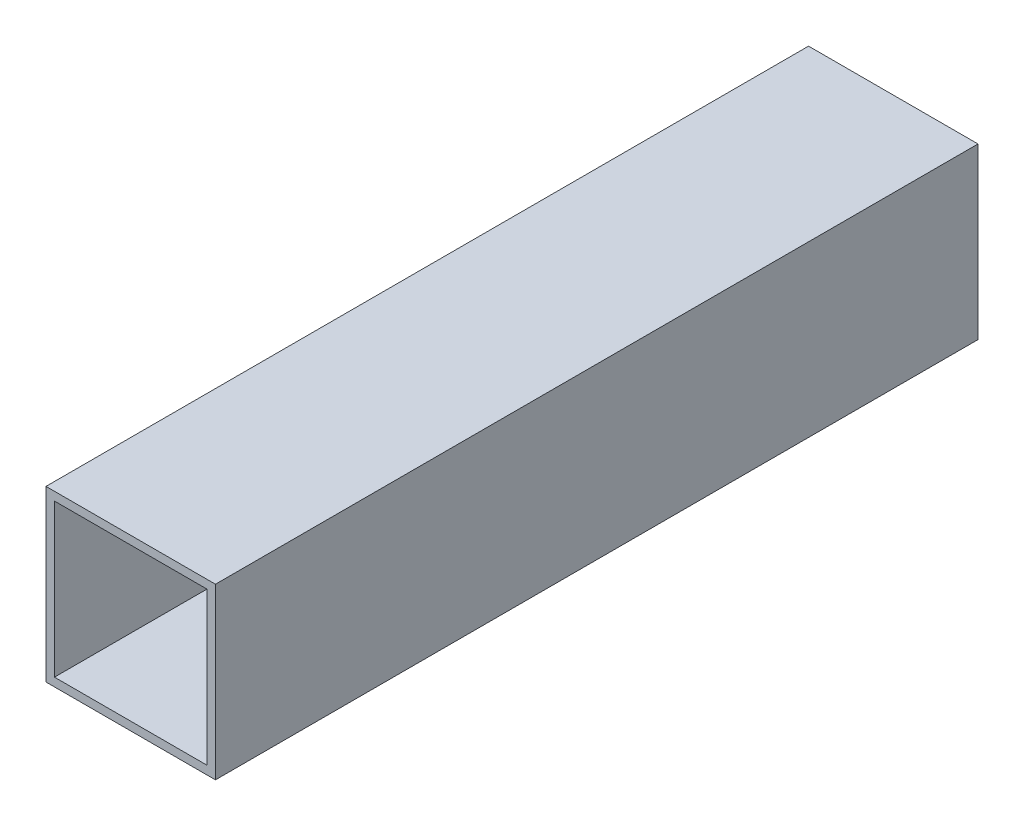
ISO-10303-21;
HEADER;
FILE_DESCRIPTION(('STEP AP214'),'2;1');
FILE_NAME('part.step','',(''),(''),'','','');
FILE_SCHEMA(('AUTOMOTIVE_DESIGN { 1 0 10303 214 1 1 1 1 }'));
ENDSEC;
DATA;
#1=APPLICATION_CONTEXT('core data for automotive mechanical design processes');
#2=APPLICATION_PROTOCOL_DEFINITION('international standard','automotive_design',2000,#1);
#3=PRODUCT_CONTEXT('',#1,'mechanical');
#4=PRODUCT('Part','Part','',(#3));
#5=PRODUCT_RELATED_PRODUCT_CATEGORY('part','',(#4));
#6=PRODUCT_DEFINITION_FORMATION('','',#4);
#7=PRODUCT_DEFINITION_CONTEXT('part definition',#1,'design');
#8=PRODUCT_DEFINITION('design','',#6,#7);
#9=PRODUCT_DEFINITION_SHAPE('','',#8);
#10=(LENGTH_UNIT() NAMED_UNIT(*) SI_UNIT(.MILLI.,.METRE.));
#11=(NAMED_UNIT(*) PLANE_ANGLE_UNIT() SI_UNIT($,.RADIAN.));
#12=(NAMED_UNIT(*) SI_UNIT($,.STERADIAN.) SOLID_ANGLE_UNIT());
#13=UNCERTAINTY_MEASURE_WITH_UNIT(LENGTH_MEASURE(1.E-05),#10,'distance_accuracy_value','');
#14=(GEOMETRIC_REPRESENTATION_CONTEXT(3) GLOBAL_UNCERTAINTY_ASSIGNED_CONTEXT((#13)) GLOBAL_UNIT_ASSIGNED_CONTEXT((#10,
#11,#12)) REPRESENTATION_CONTEXT('',''));
#15=CARTESIAN_POINT('',(0.,0.,0.));
#16=DIRECTION('',(0.,0.,1.));
#17=DIRECTION('',(1.,0.,0.));
#18=AXIS2_PLACEMENT_3D('',#15,#16,#17);
#19=CARTESIAN_POINT('',(0.,0.,225.));
#20=DIRECTION('',(0.,0.,-1.));
#21=DIRECTION('',(-1.,0.,0.));
#22=AXIS2_PLACEMENT_3D('',#19,#20,#21);
#23=PLANE('',#22);
#24=DIRECTION('',(0.,-1.,0.));
#25=VECTOR('',#24,1.);
#26=CARTESIAN_POINT('',(-50.,-50.,225.));
#27=LINE('',#26,#25);
#28=CARTESIAN_POINT('',(-50.,49.9999999999999,225.));
#29=VERTEX_POINT('',#28);
#30=CARTESIAN_POINT('',(-50.,-50.,225.));
#31=VERTEX_POINT('',#30);
#32=EDGE_CURVE('E139',#29,#31,#27,.T.);
#33=ORIENTED_EDGE('',*,*,#32,.T.);
#34=DIRECTION('',(1.,0.,0.));
#35=VECTOR('',#34,1.);
#36=CARTESIAN_POINT('',(-50.,-50.,225.));
#37=LINE('',#36,#35);
#38=CARTESIAN_POINT('',(50.,-50.,225.));
#39=VERTEX_POINT('',#38);
#40=EDGE_CURVE('E141',#31,#39,#37,.T.);
#41=ORIENTED_EDGE('',*,*,#40,.T.);
#42=DIRECTION('',(0.,1.,0.));
#43=VECTOR('',#42,1.);
#44=CARTESIAN_POINT('',(50.,-50.,225.));
#45=LINE('',#44,#43);
#46=CARTESIAN_POINT('',(49.9999999999999,49.9999999999999,225.));
#47=VERTEX_POINT('',#46);
#48=EDGE_CURVE('E148',#39,#47,#45,.T.);
#49=ORIENTED_EDGE('',*,*,#48,.T.);
#50=DIRECTION('',(-1.,0.,0.));
#51=VECTOR('',#50,1.);
#52=CARTESIAN_POINT('',(-50.,49.9999999999999,225.));
#53=LINE('',#52,#51);
#54=EDGE_CURVE('E146',#47,#29,#53,.T.);
#55=ORIENTED_EDGE('',*,*,#54,.T.);
#56=EDGE_LOOP('',(#33,#41,#49,#55));
#57=FACE_BOUND('',#56,.T.);
#58=DIRECTION('',(0.,-1.,0.));
#59=VECTOR('',#58,1.);
#60=CARTESIAN_POINT('',(-45.,-45.,225.));
#61=LINE('',#60,#59);
#62=CARTESIAN_POINT('',(-45.,44.9999999999999,225.));
#63=VERTEX_POINT('',#62);
#64=CARTESIAN_POINT('',(-45.,-45.,225.));
#65=VERTEX_POINT('',#64);
#66=EDGE_CURVE('E102',#63,#65,#61,.T.);
#67=ORIENTED_EDGE('',*,*,#66,.F.);
#68=DIRECTION('',(-1.,0.,0.));
#69=VECTOR('',#68,1.);
#70=CARTESIAN_POINT('',(-45.,44.9999999999999,225.));
#71=LINE('',#70,#69);
#72=CARTESIAN_POINT('',(45.,44.9999999999999,225.));
#73=VERTEX_POINT('',#72);
#74=EDGE_CURVE('E127',#73,#63,#71,.T.);
#75=ORIENTED_EDGE('',*,*,#74,.F.);
#76=DIRECTION('',(0.,1.,0.));
#77=VECTOR('',#76,1.);
#78=CARTESIAN_POINT('',(45.,-45.,225.));
#79=LINE('',#78,#77);
#80=CARTESIAN_POINT('',(45.,-45.,225.));
#81=VERTEX_POINT('',#80);
#82=EDGE_CURVE('E121',#81,#73,#79,.T.);
#83=ORIENTED_EDGE('',*,*,#82,.F.);
#84=DIRECTION('',(1.,0.,0.));
#85=VECTOR('',#84,1.);
#86=CARTESIAN_POINT('',(-45.,-45.,225.));
#87=LINE('',#86,#85);
#88=EDGE_CURVE('E115',#65,#81,#87,.T.);
#89=ORIENTED_EDGE('',*,*,#88,.F.);
#90=EDGE_LOOP('',(#67,#75,#83,#89));
#91=FACE_BOUND('',#90,.T.);
#92=ADVANCED_FACE('F39',(#57,#91),#23,.F.);
#93=CARTESIAN_POINT('',(0.,0.,-225.));
#94=DIRECTION('',(0.,0.,-1.));
#95=DIRECTION('',(-1.,0.,0.));
#96=AXIS2_PLACEMENT_3D('',#93,#94,#95);
#97=PLANE('',#96);
#98=DIRECTION('',(0.,-1.,0.));
#99=VECTOR('',#98,1.);
#100=CARTESIAN_POINT('',(-50.,-50.,-225.));
#101=LINE('',#100,#99);
#102=CARTESIAN_POINT('',(-50.,49.9999999999999,-225.));
#103=VERTEX_POINT('',#102);
#104=CARTESIAN_POINT('',(-50.,-50.,-225.));
#105=VERTEX_POINT('',#104);
#106=EDGE_CURVE('E118',#103,#105,#101,.T.);
#107=ORIENTED_EDGE('',*,*,#106,.F.);
#108=DIRECTION('',(-1.,0.,0.));
#109=VECTOR('',#108,1.);
#110=CARTESIAN_POINT('',(-50.,49.9999999999999,-225.));
#111=LINE('',#110,#109);
#112=CARTESIAN_POINT('',(49.9999999999999,49.9999999999999,-225.));
#113=VERTEX_POINT('',#112);
#114=EDGE_CURVE('E145',#113,#103,#111,.T.);
#115=ORIENTED_EDGE('',*,*,#114,.F.);
#116=DIRECTION('',(0.,1.,0.));
#117=VECTOR('',#116,1.);
#118=CARTESIAN_POINT('',(50.,-50.,-225.));
#119=LINE('',#118,#117);
#120=CARTESIAN_POINT('',(50.,-50.,-225.));
#121=VERTEX_POINT('',#120);
#122=EDGE_CURVE('E154',#121,#113,#119,.T.);
#123=ORIENTED_EDGE('',*,*,#122,.F.);
#124=DIRECTION('',(1.,0.,0.));
#125=VECTOR('',#124,1.);
#126=CARTESIAN_POINT('',(-50.,-50.,-225.));
#127=LINE('',#126,#125);
#128=EDGE_CURVE('E153',#105,#121,#127,.T.);
#129=ORIENTED_EDGE('',*,*,#128,.F.);
#130=EDGE_LOOP('',(#107,#115,#123,#129));
#131=FACE_BOUND('',#130,.T.);
#132=DIRECTION('',(-1.,0.,0.));
#133=VECTOR('',#132,1.);
#134=CARTESIAN_POINT('',(-45.,44.9999999999999,-225.));
#135=LINE('',#134,#133);
#136=CARTESIAN_POINT('',(45.,44.9999999999999,-225.));
#137=VERTEX_POINT('',#136);
#138=CARTESIAN_POINT('',(-45.,44.9999999999999,-225.));
#139=VERTEX_POINT('',#138);
#140=EDGE_CURVE('E114',#137,#139,#135,.T.);
#141=ORIENTED_EDGE('',*,*,#140,.T.);
#142=DIRECTION('',(0.,-1.,0.));
#143=VECTOR('',#142,1.);
#144=CARTESIAN_POINT('',(-45.,-45.,-225.));
#145=LINE('',#144,#143);
#146=CARTESIAN_POINT('',(-45.,-45.,-225.));
#147=VERTEX_POINT('',#146);
#148=EDGE_CURVE('E65',#139,#147,#145,.T.);
#149=ORIENTED_EDGE('',*,*,#148,.T.);
#150=DIRECTION('',(1.,0.,0.));
#151=VECTOR('',#150,1.);
#152=CARTESIAN_POINT('',(-45.,-45.,-225.));
#153=LINE('',#152,#151);
#154=CARTESIAN_POINT('',(45.,-45.,-225.));
#155=VERTEX_POINT('',#154);
#156=EDGE_CURVE('E116',#147,#155,#153,.T.);
#157=ORIENTED_EDGE('',*,*,#156,.T.);
#158=DIRECTION('',(0.,1.,0.));
#159=VECTOR('',#158,1.);
#160=CARTESIAN_POINT('',(45.,-45.,-225.));
#161=LINE('',#160,#159);
#162=EDGE_CURVE('E135',#155,#137,#161,.T.);
#163=ORIENTED_EDGE('',*,*,#162,.T.);
#164=EDGE_LOOP('',(#141,#149,#157,#163));
#165=FACE_BOUND('',#164,.T.);
#166=ADVANCED_FACE('F174',(#131,#165),#97,.T.);
#167=CARTESIAN_POINT('',(-50.,-50.,225.));
#168=DIRECTION('',(1.,0.,0.));
#169=DIRECTION('',(0.,0.,-1.));
#170=AXIS2_PLACEMENT_3D('',#167,#168,#169);
#171=PLANE('',#170);
#172=ORIENTED_EDGE('',*,*,#106,.T.);
#173=DIRECTION('',(0.,0.,-1.));
#174=VECTOR('',#173,1.);
#175=CARTESIAN_POINT('',(-50.,-50.,225.));
#176=LINE('',#175,#174);
#177=EDGE_CURVE('E11',#31,#105,#176,.T.);
#178=ORIENTED_EDGE('',*,*,#177,.F.);
#179=ORIENTED_EDGE('',*,*,#32,.F.);
#180=DIRECTION('',(0.,0.,-1.));
#181=VECTOR('',#180,1.);
#182=CARTESIAN_POINT('',(-50.,49.9999999999999,225.));
#183=LINE('',#182,#181);
#184=EDGE_CURVE('E147',#29,#103,#183,.T.);
#185=ORIENTED_EDGE('',*,*,#184,.T.);
#186=EDGE_LOOP('',(#172,#178,#179,#185));
#187=FACE_BOUND('',#186,.T.);
#188=ADVANCED_FACE('F41',(#187),#171,.F.);
#189=CARTESIAN_POINT('',(-50.,-50.,225.));
#190=DIRECTION('',(0.,1.,0.));
#191=DIRECTION('',(0.,0.,1.));
#192=AXIS2_PLACEMENT_3D('',#189,#190,#191);
#193=PLANE('',#192);
#194=ORIENTED_EDGE('',*,*,#128,.T.);
#195=DIRECTION('',(0.,0.,-1.));
#196=VECTOR('',#195,1.);
#197=CARTESIAN_POINT('',(50.,-50.,225.));
#198=LINE('',#197,#196);
#199=EDGE_CURVE('E50',#39,#121,#198,.T.);
#200=ORIENTED_EDGE('',*,*,#199,.F.);
#201=ORIENTED_EDGE('',*,*,#40,.F.);
#202=ORIENTED_EDGE('',*,*,#177,.T.);
#203=EDGE_LOOP('',(#194,#200,#201,#202));
#204=FACE_BOUND('',#203,.T.);
#205=ADVANCED_FACE('F181',(#204),#193,.F.);
#206=CARTESIAN_POINT('',(50.,-50.,225.));
#207=DIRECTION('',(-1.,0.,0.));
#208=DIRECTION('',(0.,-1.,0.));
#209=AXIS2_PLACEMENT_3D('',#206,#207,#208);
#210=PLANE('',#209);
#211=ORIENTED_EDGE('',*,*,#122,.T.);
#212=DIRECTION('',(0.,0.,-1.));
#213=VECTOR('',#212,1.);
#214=CARTESIAN_POINT('',(49.9999999999999,49.9999999999999,225.));
#215=LINE('',#214,#213);
#216=EDGE_CURVE('E159',#47,#113,#215,.T.);
#217=ORIENTED_EDGE('',*,*,#216,.F.);
#218=ORIENTED_EDGE('',*,*,#48,.F.);
#219=ORIENTED_EDGE('',*,*,#199,.T.);
#220=EDGE_LOOP('',(#211,#217,#218,#219));
#221=FACE_BOUND('',#220,.T.);
#222=ADVANCED_FACE('F170',(#221),#210,.F.);
#223=CARTESIAN_POINT('',(-50.,49.9999999999999,225.));
#224=DIRECTION('',(0.,-1.,0.));
#225=DIRECTION('',(0.,0.,-1.));
#226=AXIS2_PLACEMENT_3D('',#223,#224,#225);
#227=PLANE('',#226);
#228=ORIENTED_EDGE('',*,*,#114,.T.);
#229=ORIENTED_EDGE('',*,*,#184,.F.);
#230=ORIENTED_EDGE('',*,*,#54,.F.);
#231=ORIENTED_EDGE('',*,*,#216,.T.);
#232=EDGE_LOOP('',(#228,#229,#230,#231));
#233=FACE_BOUND('',#232,.T.);
#234=ADVANCED_FACE('F180',(#233),#227,.F.);
#235=CARTESIAN_POINT('',(-45.,-45.,225.));
#236=DIRECTION('',(1.,0.,0.));
#237=DIRECTION('',(0.,0.,-1.));
#238=AXIS2_PLACEMENT_3D('',#235,#236,#237);
#239=PLANE('',#238);
#240=ORIENTED_EDGE('',*,*,#148,.F.);
#241=DIRECTION('',(0.,0.,-1.));
#242=VECTOR('',#241,1.);
#243=CARTESIAN_POINT('',(-45.,44.9999999999999,225.));
#244=LINE('',#243,#242);
#245=EDGE_CURVE('E107',#63,#139,#244,.T.);
#246=ORIENTED_EDGE('',*,*,#245,.F.);
#247=ORIENTED_EDGE('',*,*,#66,.T.);
#248=DIRECTION('',(0.,0.,-1.));
#249=VECTOR('',#248,1.);
#250=CARTESIAN_POINT('',(-45.,-45.,225.));
#251=LINE('',#250,#249);
#252=EDGE_CURVE('E110',#65,#147,#251,.T.);
#253=ORIENTED_EDGE('',*,*,#252,.T.);
#254=EDGE_LOOP('',(#240,#246,#247,#253));
#255=FACE_BOUND('',#254,.T.);
#256=ADVANCED_FACE('F106',(#255),#239,.T.);
#257=CARTESIAN_POINT('',(-45.,-45.,225.));
#258=DIRECTION('',(0.,1.,0.));
#259=DIRECTION('',(0.,0.,1.));
#260=AXIS2_PLACEMENT_3D('',#257,#258,#259);
#261=PLANE('',#260);
#262=ORIENTED_EDGE('',*,*,#156,.F.);
#263=ORIENTED_EDGE('',*,*,#252,.F.);
#264=ORIENTED_EDGE('',*,*,#88,.T.);
#265=DIRECTION('',(0.,0.,-1.));
#266=VECTOR('',#265,1.);
#267=CARTESIAN_POINT('',(45.,-45.,225.));
#268=LINE('',#267,#266);
#269=EDGE_CURVE('E122',#81,#155,#268,.T.);
#270=ORIENTED_EDGE('',*,*,#269,.T.);
#271=EDGE_LOOP('',(#262,#263,#264,#270));
#272=FACE_BOUND('',#271,.T.);
#273=ADVANCED_FACE('F117',(#272),#261,.T.);
#274=CARTESIAN_POINT('',(45.,-45.,225.));
#275=DIRECTION('',(-1.,0.,0.));
#276=DIRECTION('',(0.,-1.,0.));
#277=AXIS2_PLACEMENT_3D('',#274,#275,#276);
#278=PLANE('',#277);
#279=ORIENTED_EDGE('',*,*,#162,.F.);
#280=ORIENTED_EDGE('',*,*,#269,.F.);
#281=ORIENTED_EDGE('',*,*,#82,.T.);
#282=DIRECTION('',(0.,0.,-1.));
#283=VECTOR('',#282,1.);
#284=CARTESIAN_POINT('',(45.,44.9999999999999,225.));
#285=LINE('',#284,#283);
#286=EDGE_CURVE('E53',#73,#137,#285,.T.);
#287=ORIENTED_EDGE('',*,*,#286,.T.);
#288=EDGE_LOOP('',(#279,#280,#281,#287));
#289=FACE_BOUND('',#288,.T.);
#290=ADVANCED_FACE('F206',(#289),#278,.T.);
#291=CARTESIAN_POINT('',(-45.,44.9999999999999,225.));
#292=DIRECTION('',(0.,-1.,0.));
#293=DIRECTION('',(0.,0.,-1.));
#294=AXIS2_PLACEMENT_3D('',#291,#292,#293);
#295=PLANE('',#294);
#296=ORIENTED_EDGE('',*,*,#140,.F.);
#297=ORIENTED_EDGE('',*,*,#286,.F.);
#298=ORIENTED_EDGE('',*,*,#74,.T.);
#299=ORIENTED_EDGE('',*,*,#245,.T.);
#300=EDGE_LOOP('',(#296,#297,#298,#299));
#301=FACE_BOUND('',#300,.T.);
#302=ADVANCED_FACE('F209',(#301),#295,.T.);
#303=CLOSED_SHELL('',(#92,#166,#188,#205,#222,#234,#256,#273,#290,#302));
#304=MANIFOLD_SOLID_BREP('B2',#303);
#305=ADVANCED_BREP_SHAPE_REPRESENTATION('',(#18,#304),#14);
#306=SHAPE_DEFINITION_REPRESENTATION(#9,#305);
ENDSEC;
END-ISO-10303-21;
